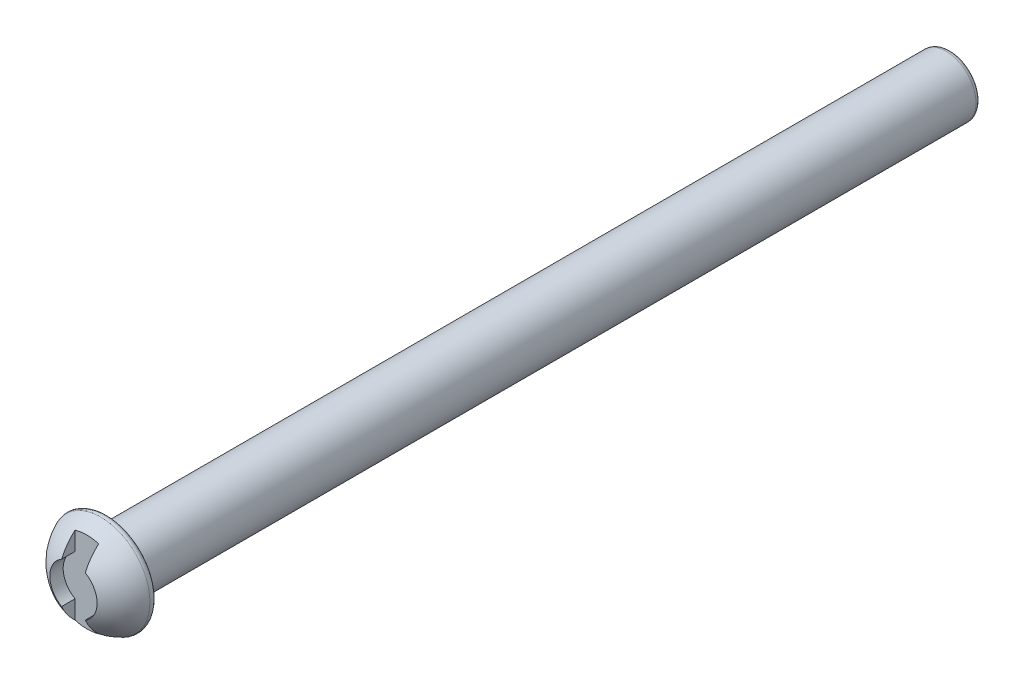
ISO-10303-21;
HEADER;
FILE_DESCRIPTION(('STEP AP214'),'2;1');
FILE_NAME('part.step','',(''),(''),'','','');
FILE_SCHEMA(('AUTOMOTIVE_DESIGN { 1 0 10303 214 1 1 1 1 }'));
ENDSEC;
DATA;
#1=APPLICATION_CONTEXT('core data for automotive mechanical design processes');
#2=APPLICATION_PROTOCOL_DEFINITION('international standard','automotive_design',2000,#1);
#3=PRODUCT_CONTEXT('',#1,'mechanical');
#4=PRODUCT('Part','Part','',(#3));
#5=PRODUCT_RELATED_PRODUCT_CATEGORY('part','',(#4));
#6=PRODUCT_DEFINITION_FORMATION('','',#4);
#7=PRODUCT_DEFINITION_CONTEXT('part definition',#1,'design');
#8=PRODUCT_DEFINITION('design','',#6,#7);
#9=PRODUCT_DEFINITION_SHAPE('','',#8);
#10=(LENGTH_UNIT() NAMED_UNIT(*) SI_UNIT(.MILLI.,.METRE.));
#11=(NAMED_UNIT(*) PLANE_ANGLE_UNIT() SI_UNIT($,.RADIAN.));
#12=(NAMED_UNIT(*) SI_UNIT($,.STERADIAN.) SOLID_ANGLE_UNIT());
#13=UNCERTAINTY_MEASURE_WITH_UNIT(LENGTH_MEASURE(1.E-05),#10,'distance_accuracy_value','');
#14=(GEOMETRIC_REPRESENTATION_CONTEXT(3) GLOBAL_UNCERTAINTY_ASSIGNED_CONTEXT((#13)) GLOBAL_UNIT_ASSIGNED_CONTEXT((#10,
#11,#12)) REPRESENTATION_CONTEXT('',''));
#15=CARTESIAN_POINT('',(0.,0.,0.));
#16=DIRECTION('',(0.,0.,1.));
#17=DIRECTION('',(1.,0.,0.));
#18=AXIS2_PLACEMENT_3D('',#15,#16,#17);
#19=CARTESIAN_POINT('',(0.,0.,-8.4388));
#20=DIRECTION('',(0.,0.,1.));
#21=DIRECTION('',(0.,1.,0.));
#22=AXIS2_PLACEMENT_3D('',#19,#20,#21);
#23=SPHERICAL_SURFACE('',#22,8.4388);
#24=CARTESIAN_POINT('',(-1.875,0.,-8.4388));
#25=DIRECTION('',(-1.,0.,0.));
#26=DIRECTION('',(0.,-1.,0.));
#27=AXIS2_PLACEMENT_3D('',#24,#25,#26);
#28=CIRCLE('',#27,8.22786244658964);
#29=CARTESIAN_POINT('',(-1.875,-6.17391083511902,-3.));
#30=VERTEX_POINT('',#29);
#31=CARTESIAN_POINT('',(-1.875,-3.24759526419165,-0.878982182089307));
#32=VERTEX_POINT('',#31);
#33=EDGE_CURVE('E144',#30,#32,#28,.T.);
#34=ORIENTED_EDGE('',*,*,#33,.T.);
#35=CARTESIAN_POINT('',(0.,0.,-0.878982182089307));
#36=DIRECTION('',(0.,0.,-1.));
#37=DIRECTION('',(-1.,0.,0.));
#38=AXIS2_PLACEMENT_3D('',#35,#36,#37);
#39=CIRCLE('',#38,3.75);
#40=CARTESIAN_POINT('',(-1.875,3.24759526419165,-0.878982182089306));
#41=VERTEX_POINT('',#40);
#42=EDGE_CURVE('E11',#32,#41,#39,.T.);
#43=ORIENTED_EDGE('',*,*,#42,.T.);
#44=CARTESIAN_POINT('',(-1.875,0.,-8.4388));
#45=DIRECTION('',(-1.,0.,0.));
#46=DIRECTION('',(0.,-1.,0.));
#47=AXIS2_PLACEMENT_3D('',#44,#45,#46);
#48=CIRCLE('',#47,8.22786244658964);
#49=CARTESIAN_POINT('',(-1.875,6.17391083511902,-3.));
#50=VERTEX_POINT('',#49);
#51=EDGE_CURVE('E41',#41,#50,#48,.T.);
#52=ORIENTED_EDGE('',*,*,#51,.T.);
#53=CARTESIAN_POINT('',(0.,0.,-3.));
#54=DIRECTION('',(0.,0.,1.));
#55=DIRECTION('',(1.,0.,0.));
#56=AXIS2_PLACEMENT_3D('',#53,#54,#55);
#57=CIRCLE('',#56,6.45234840968775);
#58=CARTESIAN_POINT('',(1.875,6.17391083511902,-3.));
#59=VERTEX_POINT('',#58);
#60=EDGE_CURVE('E137',#59,#50,#57,.T.);
#61=ORIENTED_EDGE('',*,*,#60,.F.);
#62=CARTESIAN_POINT('',(1.875,0.,-8.4388));
#63=DIRECTION('',(1.,0.,0.));
#64=DIRECTION('',(0.,1.,0.));
#65=AXIS2_PLACEMENT_3D('',#62,#63,#64);
#66=CIRCLE('',#65,8.22786244658963);
#67=CARTESIAN_POINT('',(1.875,3.24759526419164,-0.878982182089307));
#68=VERTEX_POINT('',#67);
#69=EDGE_CURVE('E141',#59,#68,#66,.T.);
#70=ORIENTED_EDGE('',*,*,#69,.T.);
#71=CARTESIAN_POINT('',(0.,0.,-0.878982182089307));
#72=DIRECTION('',(0.,0.,-1.));
#73=DIRECTION('',(-1.,0.,0.));
#74=AXIS2_PLACEMENT_3D('',#71,#72,#73);
#75=CIRCLE('',#74,3.75);
#76=CARTESIAN_POINT('',(1.875,-3.24759526419164,-0.878982182089307));
#77=VERTEX_POINT('',#76);
#78=EDGE_CURVE('E139',#68,#77,#75,.T.);
#79=ORIENTED_EDGE('',*,*,#78,.T.);
#80=CARTESIAN_POINT('',(1.875,0.,-8.4388));
#81=DIRECTION('',(1.,0.,0.));
#82=DIRECTION('',(0.,1.,0.));
#83=AXIS2_PLACEMENT_3D('',#80,#81,#82);
#84=CIRCLE('',#83,8.22786244658963);
#85=CARTESIAN_POINT('',(1.875,-6.17391083511902,-3.));
#86=VERTEX_POINT('',#85);
#87=EDGE_CURVE('E99',#77,#86,#84,.T.);
#88=ORIENTED_EDGE('',*,*,#87,.T.);
#89=EDGE_CURVE('E92',#30,#86,#57,.T.);
#90=ORIENTED_EDGE('',*,*,#89,.F.);
#91=EDGE_LOOP('',(#34,#43,#52,#61,#70,#79,#88,#90));
#92=FACE_BOUND('',#91,.T.);
#93=CARTESIAN_POINT('',(0.,0.,-5.21333628134429));
#94=DIRECTION('',(0.,0.,-1.));
#95=DIRECTION('',(-1.,0.,0.));
#96=AXIS2_PLACEMENT_3D('',#93,#94,#95);
#97=CIRCLE('',#96,7.79805932521904);
#98=CARTESIAN_POINT('',(-7.79805932521904,0.,-5.21333628134429));
#99=VERTEX_POINT('',#98);
#100=EDGE_CURVE('E130',#99,#99,#97,.F.);
#101=ORIENTED_EDGE('',*,*,#100,.T.);
#102=EDGE_LOOP('',(#101));
#103=FACE_BOUND('',#102,.T.);
#104=ADVANCED_FACE('F33',(#92,#103),#23,.T.);
#105=CARTESIAN_POINT('',(0.,0.,-140.));
#106=DIRECTION('',(0.,0.,1.));
#107=DIRECTION('',(1.,0.,0.));
#108=AXIS2_PLACEMENT_3D('',#105,#106,#107);
#109=PLANE('',#108);
#110=CARTESIAN_POINT('',(0.,0.,-140.));
#111=DIRECTION('',(0.,0.,1.));
#112=DIRECTION('',(1.,0.,0.));
#113=AXIS2_PLACEMENT_3D('',#110,#111,#112);
#114=CIRCLE('',#113,4.);
#115=CARTESIAN_POINT('',(4.,0.,-140.));
#116=VERTEX_POINT('',#115);
#117=EDGE_CURVE('E127',#116,#116,#114,.F.);
#118=ORIENTED_EDGE('',*,*,#117,.T.);
#119=EDGE_LOOP('',(#118));
#120=FACE_BOUND('',#119,.T.);
#121=ADVANCED_FACE('F169',(#120),#109,.F.);
#122=CARTESIAN_POINT('',(0.,0.,0.));
#123=DIRECTION('',(0.,0.,1.));
#124=DIRECTION('',(1.,0.,0.));
#125=AXIS2_PLACEMENT_3D('',#122,#123,#124);
#126=CYLINDRICAL_SURFACE('',#125,4.75);
#127=CARTESIAN_POINT('',(0.,0.,-139.25));
#128=DIRECTION('',(0.,0.,1.));
#129=DIRECTION('',(1.,0.,0.));
#130=AXIS2_PLACEMENT_3D('',#127,#128,#129);
#131=CIRCLE('',#130,4.75);
#132=CARTESIAN_POINT('',(4.75,0.,-139.25));
#133=VERTEX_POINT('',#132);
#134=EDGE_CURVE('E124',#133,#133,#131,.T.);
#135=ORIENTED_EDGE('',*,*,#134,.T.);
#136=EDGE_LOOP('',(#135));
#137=FACE_BOUND('',#136,.T.);
#138=CARTESIAN_POINT('',(0.,0.,-6.25));
#139=DIRECTION('',(0.,0.,1.));
#140=DIRECTION('',(1.,0.,0.));
#141=AXIS2_PLACEMENT_3D('',#138,#139,#140);
#142=CIRCLE('',#141,4.74999999999999);
#143=CARTESIAN_POINT('',(4.74999999999999,0.,-6.25));
#144=VERTEX_POINT('',#143);
#145=EDGE_CURVE('E118',#144,#144,#142,.T.);
#146=ORIENTED_EDGE('',*,*,#145,.F.);
#147=EDGE_LOOP('',(#146));
#148=FACE_BOUND('',#147,.T.);
#149=ADVANCED_FACE('F174',(#137,#148),#126,.T.);
#150=CARTESIAN_POINT('',(0.,4.74999999999999,-6.25));
#151=DIRECTION('',(0.,0.,1.));
#152=DIRECTION('',(1.,0.,0.));
#153=AXIS2_PLACEMENT_3D('',#150,#151,#152);
#154=PLANE('',#153);
#155=CARTESIAN_POINT('',(0.,0.,-6.25));
#156=DIRECTION('',(0.,0.,1.));
#157=DIRECTION('',(1.,0.,0.));
#158=AXIS2_PLACEMENT_3D('',#155,#156,#157);
#159=CIRCLE('',#158,7.1050052779713);
#160=CARTESIAN_POINT('',(7.1050052779713,0.,-6.25));
#161=VERTEX_POINT('',#160);
#162=EDGE_CURVE('E133',#161,#161,#159,.F.);
#163=ORIENTED_EDGE('',*,*,#162,.T.);
#164=EDGE_LOOP('',(#163));
#165=FACE_BOUND('',#164,.T.);
#166=ORIENTED_EDGE('',*,*,#145,.T.);
#167=EDGE_LOOP('',(#166));
#168=FACE_BOUND('',#167,.T.);
#169=ADVANCED_FACE('F180',(#165,#168),#154,.F.);
#170=CARTESIAN_POINT('',(0.,0.,-139.25));
#171=DIRECTION('',(0.,0.,1.));
#172=DIRECTION('',(1.,0.,0.));
#173=AXIS2_PLACEMENT_3D('',#170,#171,#172);
#174=TOROIDAL_SURFACE('',#173,4.,0.75);
#175=ORIENTED_EDGE('',*,*,#117,.F.);
#176=EDGE_LOOP('',(#175));
#177=FACE_BOUND('',#176,.T.);
#178=ORIENTED_EDGE('',*,*,#134,.F.);
#179=EDGE_LOOP('',(#178));
#180=FACE_BOUND('',#179,.T.);
#181=ADVANCED_FACE('F178',(#177,#180),#174,.T.);
#182=CARTESIAN_POINT('',(0.,0.,-5.5));
#183=DIRECTION('',(0.,0.,1.));
#184=DIRECTION('',(1.,0.,0.));
#185=AXIS2_PLACEMENT_3D('',#182,#183,#184);
#186=TOROIDAL_SURFACE('',#185,7.1050052779713,0.75);
#187=ORIENTED_EDGE('',*,*,#162,.F.);
#188=EDGE_LOOP('',(#187));
#189=FACE_BOUND('',#188,.T.);
#190=ORIENTED_EDGE('',*,*,#100,.F.);
#191=EDGE_LOOP('',(#190));
#192=FACE_BOUND('',#191,.T.);
#193=ADVANCED_FACE('F35',(#189,#192),#186,.T.);
#194=CARTESIAN_POINT('',(-1.875,-3.24759526419165,-3.));
#195=DIRECTION('',(-1.,0.,0.));
#196=DIRECTION('',(0.,-1.,0.));
#197=AXIS2_PLACEMENT_3D('',#194,#195,#196);
#198=PLANE('',#197);
#199=DIRECTION('',(0.,-1.,0.));
#200=VECTOR('',#199,1.);
#201=CARTESIAN_POINT('',(-1.875,-3.24759526419165,-3.));
#202=LINE('',#201,#200);
#203=CARTESIAN_POINT('',(-1.875,-3.24759526419165,-3.));
#204=VERTEX_POINT('',#203);
#205=EDGE_CURVE('E48',#204,#30,#202,.T.);
#206=ORIENTED_EDGE('',*,*,#205,.F.);
#207=DIRECTION('',(0.,0.,1.));
#208=VECTOR('',#207,1.);
#209=CARTESIAN_POINT('',(-1.875,-3.24759526419165,-3.));
#210=LINE('',#209,#208);
#211=EDGE_CURVE('E116',#204,#32,#210,.T.);
#212=ORIENTED_EDGE('',*,*,#211,.T.);
#213=ORIENTED_EDGE('',*,*,#33,.F.);
#214=EDGE_LOOP('',(#206,#212,#213));
#215=FACE_BOUND('',#214,.T.);
#216=ADVANCED_FACE('F156',(#215),#198,.F.);
#217=CARTESIAN_POINT('',(0.,0.,-3.));
#218=DIRECTION('',(0.,0.,1.));
#219=DIRECTION('',(1.,0.,0.));
#220=AXIS2_PLACEMENT_3D('',#217,#218,#219);
#221=CYLINDRICAL_SURFACE('',#220,3.75);
#222=ORIENTED_EDGE('',*,*,#211,.F.);
#223=CARTESIAN_POINT('',(0.,0.,-3.));
#224=DIRECTION('',(0.,0.,1.));
#225=DIRECTION('',(1.,0.,0.));
#226=AXIS2_PLACEMENT_3D('',#223,#224,#225);
#227=CIRCLE('',#226,3.75);
#228=CARTESIAN_POINT('',(-1.875,3.24759526419165,-3.));
#229=VERTEX_POINT('',#228);
#230=EDGE_CURVE('E113',#229,#204,#227,.T.);
#231=ORIENTED_EDGE('',*,*,#230,.F.);
#232=DIRECTION('',(0.,0.,1.));
#233=VECTOR('',#232,1.);
#234=CARTESIAN_POINT('',(-1.875,3.24759526419165,-3.));
#235=LINE('',#234,#233);
#236=EDGE_CURVE('E119',#229,#41,#235,.T.);
#237=ORIENTED_EDGE('',*,*,#236,.T.);
#238=ORIENTED_EDGE('',*,*,#42,.F.);
#239=EDGE_LOOP('',(#222,#231,#237,#238));
#240=FACE_BOUND('',#239,.T.);
#241=ADVANCED_FACE('F154',(#240),#221,.F.);
#242=CARTESIAN_POINT('',(-1.875,9.32924432801642,-3.));
#243=DIRECTION('',(-1.,0.,0.));
#244=DIRECTION('',(0.,-1.,0.));
#245=AXIS2_PLACEMENT_3D('',#242,#243,#244);
#246=PLANE('',#245);
#247=ORIENTED_EDGE('',*,*,#236,.F.);
#248=DIRECTION('',(0.,-1.,0.));
#249=VECTOR('',#248,1.);
#250=CARTESIAN_POINT('',(-1.875,9.32924432801642,-3.));
#251=LINE('',#250,#249);
#252=EDGE_CURVE('E109',#50,#229,#251,.T.);
#253=ORIENTED_EDGE('',*,*,#252,.F.);
#254=ORIENTED_EDGE('',*,*,#51,.F.);
#255=EDGE_LOOP('',(#247,#253,#254));
#256=FACE_BOUND('',#255,.T.);
#257=ADVANCED_FACE('F152',(#256),#246,.F.);
#258=CARTESIAN_POINT('',(1.875,9.32924432801642,-3.));
#259=DIRECTION('',(1.,0.,0.));
#260=DIRECTION('',(0.,1.,0.));
#261=AXIS2_PLACEMENT_3D('',#258,#259,#260);
#262=PLANE('',#261);
#263=DIRECTION('',(0.,1.,0.));
#264=VECTOR('',#263,1.);
#265=CARTESIAN_POINT('',(1.875,9.32924432801642,-3.));
#266=LINE('',#265,#264);
#267=CARTESIAN_POINT('',(1.875,3.24759526419164,-3.));
#268=VERTEX_POINT('',#267);
#269=EDGE_CURVE('E107',#268,#59,#266,.T.);
#270=ORIENTED_EDGE('',*,*,#269,.F.);
#271=DIRECTION('',(0.,0.,1.));
#272=VECTOR('',#271,1.);
#273=CARTESIAN_POINT('',(1.875,3.24759526419164,-3.));
#274=LINE('',#273,#272);
#275=EDGE_CURVE('E102',#268,#68,#274,.T.);
#276=ORIENTED_EDGE('',*,*,#275,.T.);
#277=ORIENTED_EDGE('',*,*,#69,.F.);
#278=EDGE_LOOP('',(#270,#276,#277));
#279=FACE_BOUND('',#278,.T.);
#280=ADVANCED_FACE('F159',(#279),#262,.F.);
#281=CARTESIAN_POINT('',(0.,0.,-3.));
#282=DIRECTION('',(0.,0.,1.));
#283=DIRECTION('',(1.,0.,0.));
#284=AXIS2_PLACEMENT_3D('',#281,#282,#283);
#285=CYLINDRICAL_SURFACE('',#284,3.75);
#286=ORIENTED_EDGE('',*,*,#275,.F.);
#287=CARTESIAN_POINT('',(0.,0.,-3.));
#288=DIRECTION('',(0.,0.,1.));
#289=DIRECTION('',(1.,0.,0.));
#290=AXIS2_PLACEMENT_3D('',#287,#288,#289);
#291=CIRCLE('',#290,3.75);
#292=CARTESIAN_POINT('',(1.875,-3.24759526419164,-3.));
#293=VERTEX_POINT('',#292);
#294=EDGE_CURVE('E90',#293,#268,#291,.T.);
#295=ORIENTED_EDGE('',*,*,#294,.F.);
#296=DIRECTION('',(0.,0.,1.));
#297=VECTOR('',#296,1.);
#298=CARTESIAN_POINT('',(1.875,-3.24759526419164,-3.));
#299=LINE('',#298,#297);
#300=EDGE_CURVE('E97',#293,#77,#299,.T.);
#301=ORIENTED_EDGE('',*,*,#300,.T.);
#302=ORIENTED_EDGE('',*,*,#78,.F.);
#303=EDGE_LOOP('',(#286,#295,#301,#302));
#304=FACE_BOUND('',#303,.T.);
#305=ADVANCED_FACE('F104',(#304),#285,.F.);
#306=CARTESIAN_POINT('',(1.875,-3.24759526419164,-3.));
#307=DIRECTION('',(1.,0.,0.));
#308=DIRECTION('',(0.,1.,0.));
#309=AXIS2_PLACEMENT_3D('',#306,#307,#308);
#310=PLANE('',#309);
#311=ORIENTED_EDGE('',*,*,#300,.F.);
#312=DIRECTION('',(0.,1.,0.));
#313=VECTOR('',#312,1.);
#314=CARTESIAN_POINT('',(1.875,-3.24759526419164,-3.));
#315=LINE('',#314,#313);
#316=EDGE_CURVE('E85',#86,#293,#315,.T.);
#317=ORIENTED_EDGE('',*,*,#316,.F.);
#318=ORIENTED_EDGE('',*,*,#87,.F.);
#319=EDGE_LOOP('',(#311,#317,#318));
#320=FACE_BOUND('',#319,.T.);
#321=ADVANCED_FACE('F98',(#320),#310,.F.);
#322=CARTESIAN_POINT('',(0.,0.,-3.));
#323=DIRECTION('',(0.,0.,1.));
#324=DIRECTION('',(1.,0.,0.));
#325=AXIS2_PLACEMENT_3D('',#322,#323,#324);
#326=PLANE('',#325);
#327=ORIENTED_EDGE('',*,*,#60,.T.);
#328=ORIENTED_EDGE('',*,*,#252,.T.);
#329=ORIENTED_EDGE('',*,*,#230,.T.);
#330=ORIENTED_EDGE('',*,*,#205,.T.);
#331=ORIENTED_EDGE('',*,*,#89,.T.);
#332=ORIENTED_EDGE('',*,*,#316,.T.);
#333=ORIENTED_EDGE('',*,*,#294,.T.);
#334=ORIENTED_EDGE('',*,*,#269,.T.);
#335=EDGE_LOOP('',(#327,#328,#329,#330,#331,#332,#333,#334));
#336=FACE_BOUND('',#335,.T.);
#337=ADVANCED_FACE('F87',(#336),#326,.T.);
#338=CLOSED_SHELL('',(#104,#121,#149,#169,#181,#193,#216,#241,#257,#280,#305,#321,#337));
#339=MANIFOLD_SOLID_BREP('B2',#338);
#340=ADVANCED_BREP_SHAPE_REPRESENTATION('',(#18,#339),#14);
#341=SHAPE_DEFINITION_REPRESENTATION(#9,#340);
ENDSEC;
END-ISO-10303-21;
